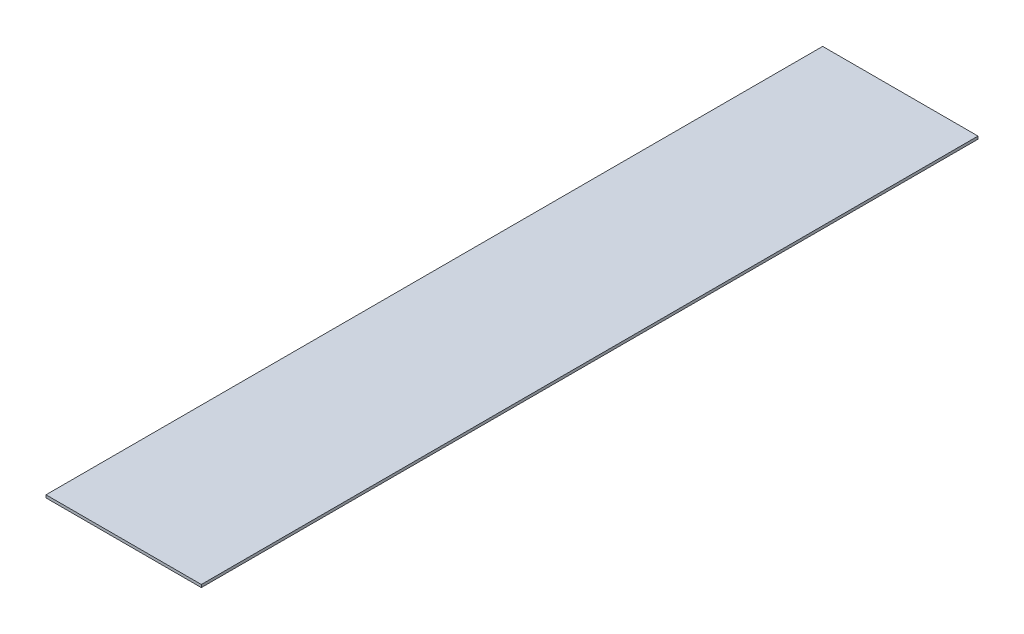
ISO-10303-21;
HEADER;
FILE_DESCRIPTION(('STEP AP214'),'2;1');
FILE_NAME('part.step','',(''),(''),'','','');
FILE_SCHEMA(('AUTOMOTIVE_DESIGN { 1 0 10303 214 1 1 1 1 }'));
ENDSEC;
DATA;
#1=APPLICATION_CONTEXT('core data for automotive mechanical design processes');
#2=APPLICATION_PROTOCOL_DEFINITION('international standard','automotive_design',2000,#1);
#3=PRODUCT_CONTEXT('',#1,'mechanical');
#4=PRODUCT('Part','Part','',(#3));
#5=PRODUCT_RELATED_PRODUCT_CATEGORY('part','',(#4));
#6=PRODUCT_DEFINITION_FORMATION('','',#4);
#7=PRODUCT_DEFINITION_CONTEXT('part definition',#1,'design');
#8=PRODUCT_DEFINITION('design','',#6,#7);
#9=PRODUCT_DEFINITION_SHAPE('','',#8);
#10=(LENGTH_UNIT() NAMED_UNIT(*) SI_UNIT(.MILLI.,.METRE.));
#11=(NAMED_UNIT(*) PLANE_ANGLE_UNIT() SI_UNIT($,.RADIAN.));
#12=(NAMED_UNIT(*) SI_UNIT($,.STERADIAN.) SOLID_ANGLE_UNIT());
#13=UNCERTAINTY_MEASURE_WITH_UNIT(LENGTH_MEASURE(1.E-05),#10,'distance_accuracy_value','');
#14=(GEOMETRIC_REPRESENTATION_CONTEXT(3) GLOBAL_UNCERTAINTY_ASSIGNED_CONTEXT((#13)) GLOBAL_UNIT_ASSIGNED_CONTEXT((#10,
#11,#12)) REPRESENTATION_CONTEXT('',''));
#15=CARTESIAN_POINT('',(0.,0.,0.));
#16=DIRECTION('',(0.,0.,1.));
#17=DIRECTION('',(1.,0.,0.));
#18=AXIS2_PLACEMENT_3D('',#15,#16,#17);
#19=CARTESIAN_POINT('',(0.,0.,1.70234197109191E-13));
#20=DIRECTION('',(0.,1.,0.));
#21=DIRECTION('',(0.,0.,1.));
#22=AXIS2_PLACEMENT_3D('',#19,#20,#21);
#23=PLANE('',#22);
#24=DIRECTION('',(0.,0.,1.));
#25=VECTOR('',#24,1.);
#26=CARTESIAN_POINT('',(-85.,0.,425.));
#27=LINE('',#26,#25);
#28=CARTESIAN_POINT('',(-85.,0.,-425.));
#29=VERTEX_POINT('',#28);
#30=CARTESIAN_POINT('',(-85.,0.,425.));
#31=VERTEX_POINT('',#30);
#32=EDGE_CURVE('E45',#29,#31,#27,.T.);
#33=ORIENTED_EDGE('',*,*,#32,.F.);
#34=DIRECTION('',(-1.,0.,0.));
#35=VECTOR('',#34,1.);
#36=CARTESIAN_POINT('',(-85.,0.,-425.));
#37=LINE('',#36,#35);
#38=CARTESIAN_POINT('',(85.,0.,-425.));
#39=VERTEX_POINT('',#38);
#40=EDGE_CURVE('E105',#39,#29,#37,.T.);
#41=ORIENTED_EDGE('',*,*,#40,.F.);
#42=DIRECTION('',(0.,0.,-1.));
#43=VECTOR('',#42,1.);
#44=CARTESIAN_POINT('',(85.,0.,-425.));
#45=LINE('',#44,#43);
#46=CARTESIAN_POINT('',(85.0000000000001,0.,425.));
#47=VERTEX_POINT('',#46);
#48=EDGE_CURVE('E93',#47,#39,#45,.T.);
#49=ORIENTED_EDGE('',*,*,#48,.F.);
#50=DIRECTION('',(1.,0.,0.));
#51=VECTOR('',#50,1.);
#52=CARTESIAN_POINT('',(85.0000000000001,0.,425.));
#53=LINE('',#52,#51);
#54=EDGE_CURVE('E80',#31,#47,#53,.T.);
#55=ORIENTED_EDGE('',*,*,#54,.F.);
#56=EDGE_LOOP('',(#33,#41,#49,#55));
#57=FACE_BOUND('',#56,.T.);
#58=ADVANCED_FACE('F42',(#57),#23,.F.);
#59=CARTESIAN_POINT('',(-85.,0.,425.));
#60=DIRECTION('',(-1.,0.,0.));
#61=DIRECTION('',(0.,0.,1.));
#62=AXIS2_PLACEMENT_3D('',#59,#60,#61);
#63=PLANE('',#62);
#64=ORIENTED_EDGE('',*,*,#32,.T.);
#65=DIRECTION('',(0.,1.,0.));
#66=VECTOR('',#65,1.);
#67=CARTESIAN_POINT('',(-85.,0.,425.));
#68=LINE('',#67,#66);
#69=CARTESIAN_POINT('',(-85.,3.,425.));
#70=VERTEX_POINT('',#69);
#71=EDGE_CURVE('E86',#70,#31,#68,.F.);
#72=ORIENTED_EDGE('',*,*,#71,.F.);
#73=DIRECTION('',(0.,0.,1.));
#74=VECTOR('',#73,1.);
#75=CARTESIAN_POINT('',(-85.,3.,1.70234197109191E-13));
#76=LINE('',#75,#74);
#77=CARTESIAN_POINT('',(-85.,3.,-425.));
#78=VERTEX_POINT('',#77);
#79=EDGE_CURVE('E108',#78,#70,#76,.T.);
#80=ORIENTED_EDGE('',*,*,#79,.F.);
#81=DIRECTION('',(0.,1.,0.));
#82=VECTOR('',#81,1.);
#83=CARTESIAN_POINT('',(-85.,0.,-425.));
#84=LINE('',#83,#82);
#85=EDGE_CURVE('E89',#29,#78,#84,.T.);
#86=ORIENTED_EDGE('',*,*,#85,.F.);
#87=EDGE_LOOP('',(#64,#72,#80,#86));
#88=FACE_BOUND('',#87,.T.);
#89=ADVANCED_FACE('F85',(#88),#63,.T.);
#90=CARTESIAN_POINT('',(85.0000000000001,0.,425.));
#91=DIRECTION('',(0.,0.,1.));
#92=DIRECTION('',(1.,0.,0.));
#93=AXIS2_PLACEMENT_3D('',#90,#91,#92);
#94=PLANE('',#93);
#95=ORIENTED_EDGE('',*,*,#54,.T.);
#96=DIRECTION('',(0.,1.,0.));
#97=VECTOR('',#96,1.);
#98=CARTESIAN_POINT('',(85.0000000000002,0.,425.));
#99=LINE('',#98,#97);
#100=CARTESIAN_POINT('',(85.0000000000001,3.,425.));
#101=VERTEX_POINT('',#100);
#102=EDGE_CURVE('E95',#101,#47,#99,.F.);
#103=ORIENTED_EDGE('',*,*,#102,.F.);
#104=DIRECTION('',(1.,0.,0.));
#105=VECTOR('',#104,1.);
#106=CARTESIAN_POINT('',(0.,3.,425.));
#107=LINE('',#106,#105);
#108=EDGE_CURVE('E99',#70,#101,#107,.T.);
#109=ORIENTED_EDGE('',*,*,#108,.F.);
#110=ORIENTED_EDGE('',*,*,#71,.T.);
#111=EDGE_LOOP('',(#95,#103,#109,#110));
#112=FACE_BOUND('',#111,.T.);
#113=ADVANCED_FACE('F97',(#112),#94,.T.);
#114=CARTESIAN_POINT('',(85.,0.,-425.));
#115=DIRECTION('',(1.,0.,0.));
#116=DIRECTION('',(0.,0.,-1.));
#117=AXIS2_PLACEMENT_3D('',#114,#115,#116);
#118=PLANE('',#117);
#119=ORIENTED_EDGE('',*,*,#48,.T.);
#120=DIRECTION('',(0.,1.,0.));
#121=VECTOR('',#120,1.);
#122=CARTESIAN_POINT('',(85.,0.,-425.));
#123=LINE('',#122,#121);
#124=CARTESIAN_POINT('',(85.,3.,-425.));
#125=VERTEX_POINT('',#124);
#126=EDGE_CURVE('E60',#125,#39,#123,.F.);
#127=ORIENTED_EDGE('',*,*,#126,.F.);
#128=DIRECTION('',(0.,0.,1.));
#129=VECTOR('',#128,1.);
#130=CARTESIAN_POINT('',(85.0000000000001,3.,1.70234197109191E-13));
#131=LINE('',#130,#129);
#132=EDGE_CURVE('E51',#101,#125,#131,.F.);
#133=ORIENTED_EDGE('',*,*,#132,.F.);
#134=ORIENTED_EDGE('',*,*,#102,.T.);
#135=EDGE_LOOP('',(#119,#127,#133,#134));
#136=FACE_BOUND('',#135,.T.);
#137=ADVANCED_FACE('F114',(#136),#118,.T.);
#138=CARTESIAN_POINT('',(-85.,0.,-425.));
#139=DIRECTION('',(0.,0.,-1.));
#140=DIRECTION('',(-1.,0.,0.));
#141=AXIS2_PLACEMENT_3D('',#138,#139,#140);
#142=PLANE('',#141);
#143=ORIENTED_EDGE('',*,*,#40,.T.);
#144=ORIENTED_EDGE('',*,*,#85,.T.);
#145=DIRECTION('',(1.,0.,0.));
#146=VECTOR('',#145,1.);
#147=CARTESIAN_POINT('',(0.,3.,-425.));
#148=LINE('',#147,#146);
#149=EDGE_CURVE('E11',#125,#78,#148,.F.);
#150=ORIENTED_EDGE('',*,*,#149,.F.);
#151=ORIENTED_EDGE('',*,*,#126,.T.);
#152=EDGE_LOOP('',(#143,#144,#150,#151));
#153=FACE_BOUND('',#152,.T.);
#154=ADVANCED_FACE('F116',(#153),#142,.T.);
#155=CARTESIAN_POINT('',(0.,3.,1.70234197109191E-13));
#156=DIRECTION('',(0.,1.,0.));
#157=DIRECTION('',(0.,0.,1.));
#158=AXIS2_PLACEMENT_3D('',#155,#156,#157);
#159=PLANE('',#158);
#160=ORIENTED_EDGE('',*,*,#132,.T.);
#161=ORIENTED_EDGE('',*,*,#149,.T.);
#162=ORIENTED_EDGE('',*,*,#79,.T.);
#163=ORIENTED_EDGE('',*,*,#108,.T.);
#164=EDGE_LOOP('',(#160,#161,#162,#163));
#165=FACE_BOUND('',#164,.T.);
#166=ADVANCED_FACE('F113',(#165),#159,.T.);
#167=CLOSED_SHELL('',(#58,#89,#113,#137,#154,#166));
#168=MANIFOLD_SOLID_BREP('B2',#167);
#169=ADVANCED_BREP_SHAPE_REPRESENTATION('',(#18,#168),#14);
#170=SHAPE_DEFINITION_REPRESENTATION(#9,#169);
ENDSEC;
END-ISO-10303-21;
